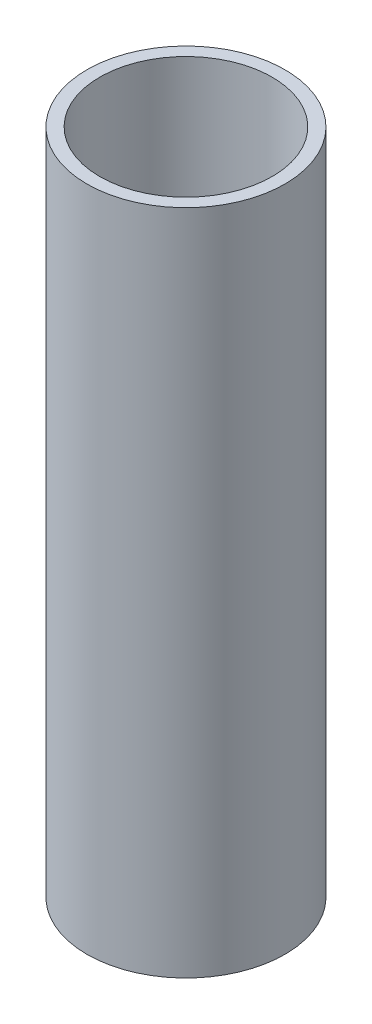
ISO-10303-21;
HEADER;
FILE_DESCRIPTION(('STEP AP214'),'2;1');
FILE_NAME('part.step','',(''),(''),'','','');
FILE_SCHEMA(('AUTOMOTIVE_DESIGN { 1 0 10303 214 1 1 1 1 }'));
ENDSEC;
DATA;
#1=APPLICATION_CONTEXT('core data for automotive mechanical design processes');
#2=APPLICATION_PROTOCOL_DEFINITION('international standard','automotive_design',2000,#1);
#3=PRODUCT_CONTEXT('',#1,'mechanical');
#4=PRODUCT('Part','Part','',(#3));
#5=PRODUCT_RELATED_PRODUCT_CATEGORY('part','',(#4));
#6=PRODUCT_DEFINITION_FORMATION('','',#4);
#7=PRODUCT_DEFINITION_CONTEXT('part definition',#1,'design');
#8=PRODUCT_DEFINITION('design','',#6,#7);
#9=PRODUCT_DEFINITION_SHAPE('','',#8);
#10=(LENGTH_UNIT() NAMED_UNIT(*) SI_UNIT(.MILLI.,.METRE.));
#11=(NAMED_UNIT(*) PLANE_ANGLE_UNIT() SI_UNIT($,.RADIAN.));
#12=(NAMED_UNIT(*) SI_UNIT($,.STERADIAN.) SOLID_ANGLE_UNIT());
#13=UNCERTAINTY_MEASURE_WITH_UNIT(LENGTH_MEASURE(1.E-05),#10,'distance_accuracy_value','');
#14=(GEOMETRIC_REPRESENTATION_CONTEXT(3) GLOBAL_UNCERTAINTY_ASSIGNED_CONTEXT((#13)) GLOBAL_UNIT_ASSIGNED_CONTEXT((#10,
#11,#12)) REPRESENTATION_CONTEXT('',''));
#15=CARTESIAN_POINT('',(0.,0.,0.));
#16=DIRECTION('',(0.,0.,1.));
#17=DIRECTION('',(1.,0.,0.));
#18=AXIS2_PLACEMENT_3D('',#15,#16,#17);
#19=CARTESIAN_POINT('',(0.,203.2,0.));
#20=DIRECTION('',(0.,1.,0.));
#21=DIRECTION('',(0.,0.,1.));
#22=AXIS2_PLACEMENT_3D('',#19,#20,#21);
#23=PLANE('',#22);
#24=CARTESIAN_POINT('',(0.,203.2,0.));
#25=DIRECTION('',(0.,1.,0.));
#26=DIRECTION('',(0.,0.,1.));
#27=AXIS2_PLACEMENT_3D('',#24,#25,#26);
#28=CIRCLE('',#27,30.1625);
#29=CARTESIAN_POINT('',(0.,203.2,30.1625));
#30=VERTEX_POINT('',#29);
#31=EDGE_CURVE('E10',#30,#30,#28,.T.);
#32=ORIENTED_EDGE('',*,*,#31,.T.);
#33=EDGE_LOOP('',(#32));
#34=FACE_BOUND('',#33,.T.);
#35=CARTESIAN_POINT('',(0.,203.2,0.));
#36=DIRECTION('',(0.,1.,0.));
#37=DIRECTION('',(0.,0.,1.));
#38=AXIS2_PLACEMENT_3D('',#35,#36,#37);
#39=CIRCLE('',#38,26.2509);
#40=CARTESIAN_POINT('',(0.,203.2,26.2509));
#41=VERTEX_POINT('',#40);
#42=EDGE_CURVE('E42',#41,#41,#39,.T.);
#43=ORIENTED_EDGE('',*,*,#42,.F.);
#44=EDGE_LOOP('',(#43));
#45=FACE_BOUND('',#44,.T.);
#46=ADVANCED_FACE('F31',(#34,#45),#23,.T.);
#47=CARTESIAN_POINT('',(0.,0.,0.));
#48=DIRECTION('',(0.,1.,0.));
#49=DIRECTION('',(0.,0.,1.));
#50=AXIS2_PLACEMENT_3D('',#47,#48,#49);
#51=PLANE('',#50);
#52=CARTESIAN_POINT('',(0.,0.,0.));
#53=DIRECTION('',(0.,1.,0.));
#54=DIRECTION('',(0.,0.,1.));
#55=AXIS2_PLACEMENT_3D('',#52,#53,#54);
#56=CIRCLE('',#55,30.1625);
#57=CARTESIAN_POINT('',(0.,0.,30.1625));
#58=VERTEX_POINT('',#57);
#59=EDGE_CURVE('E35',#58,#58,#56,.T.);
#60=ORIENTED_EDGE('',*,*,#59,.F.);
#61=EDGE_LOOP('',(#60));
#62=FACE_BOUND('',#61,.T.);
#63=CARTESIAN_POINT('',(0.,0.,0.));
#64=DIRECTION('',(0.,1.,0.));
#65=DIRECTION('',(0.,0.,1.));
#66=AXIS2_PLACEMENT_3D('',#63,#64,#65);
#67=CIRCLE('',#66,26.2509);
#68=CARTESIAN_POINT('',(0.,0.,26.2509));
#69=VERTEX_POINT('',#68);
#70=EDGE_CURVE('E44',#69,#69,#67,.T.);
#71=ORIENTED_EDGE('',*,*,#70,.T.);
#72=EDGE_LOOP('',(#71));
#73=FACE_BOUND('',#72,.T.);
#74=ADVANCED_FACE('F54',(#62,#73),#51,.F.);
#75=CARTESIAN_POINT('',(0.,203.2,0.));
#76=DIRECTION('',(0.,-1.,0.));
#77=DIRECTION('',(0.,0.,-1.));
#78=AXIS2_PLACEMENT_3D('',#75,#76,#77);
#79=CYLINDRICAL_SURFACE('',#78,30.1625);
#80=ORIENTED_EDGE('',*,*,#31,.F.);
#81=EDGE_LOOP('',(#80));
#82=FACE_BOUND('',#81,.T.);
#83=ORIENTED_EDGE('',*,*,#59,.T.);
#84=EDGE_LOOP('',(#83));
#85=FACE_BOUND('',#84,.T.);
#86=ADVANCED_FACE('F33',(#82,#85),#79,.T.);
#87=CARTESIAN_POINT('',(0.,203.2,0.));
#88=DIRECTION('',(0.,-1.,0.));
#89=DIRECTION('',(0.,0.,-1.));
#90=AXIS2_PLACEMENT_3D('',#87,#88,#89);
#91=CYLINDRICAL_SURFACE('',#90,26.2509);
#92=ORIENTED_EDGE('',*,*,#42,.T.);
#93=EDGE_LOOP('',(#92));
#94=FACE_BOUND('',#93,.T.);
#95=ORIENTED_EDGE('',*,*,#70,.F.);
#96=EDGE_LOOP('',(#95));
#97=FACE_BOUND('',#96,.T.);
#98=ADVANCED_FACE('F50',(#94,#97),#91,.F.);
#99=CLOSED_SHELL('',(#46,#74,#86,#98));
#100=MANIFOLD_SOLID_BREP('B2',#99);
#101=ADVANCED_BREP_SHAPE_REPRESENTATION('',(#18,#100),#14);
#102=SHAPE_DEFINITION_REPRESENTATION(#9,#101);
ENDSEC;
END-ISO-10303-21;
